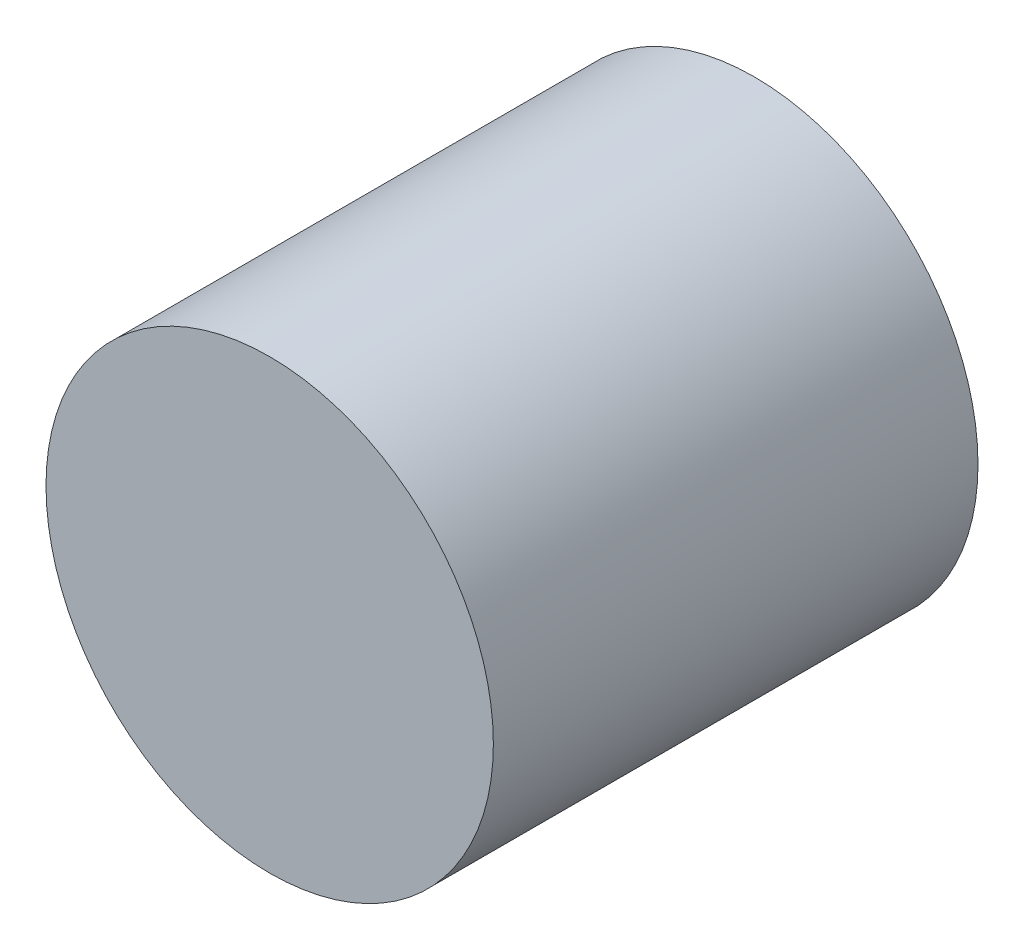
ISO-10303-21;
HEADER;
FILE_DESCRIPTION(('STEP AP214'),'2;1');
FILE_NAME('part.step','',(''),(''),'','','');
FILE_SCHEMA(('AUTOMOTIVE_DESIGN { 1 0 10303 214 1 1 1 1 }'));
ENDSEC;
DATA;
#1=APPLICATION_CONTEXT('core data for automotive mechanical design processes');
#2=APPLICATION_PROTOCOL_DEFINITION('international standard','automotive_design',2000,#1);
#3=PRODUCT_CONTEXT('',#1,'mechanical');
#4=PRODUCT('Part','Part','',(#3));
#5=PRODUCT_RELATED_PRODUCT_CATEGORY('part','',(#4));
#6=PRODUCT_DEFINITION_FORMATION('','',#4);
#7=PRODUCT_DEFINITION_CONTEXT('part definition',#1,'design');
#8=PRODUCT_DEFINITION('design','',#6,#7);
#9=PRODUCT_DEFINITION_SHAPE('','',#8);
#10=(LENGTH_UNIT() NAMED_UNIT(*) SI_UNIT(.MILLI.,.METRE.));
#11=(NAMED_UNIT(*) PLANE_ANGLE_UNIT() SI_UNIT($,.RADIAN.));
#12=(NAMED_UNIT(*) SI_UNIT($,.STERADIAN.) SOLID_ANGLE_UNIT());
#13=UNCERTAINTY_MEASURE_WITH_UNIT(LENGTH_MEASURE(1.E-05),#10,'distance_accuracy_value','');
#14=(GEOMETRIC_REPRESENTATION_CONTEXT(3) GLOBAL_UNCERTAINTY_ASSIGNED_CONTEXT((#13)) GLOBAL_UNIT_ASSIGNED_CONTEXT((#10,
#11,#12)) REPRESENTATION_CONTEXT('',''));
#15=CARTESIAN_POINT('',(0.,0.,0.));
#16=DIRECTION('',(0.,0.,1.));
#17=DIRECTION('',(1.,0.,0.));
#18=AXIS2_PLACEMENT_3D('',#15,#16,#17);
#19=CARTESIAN_POINT('',(0.,0.,6.5));
#20=DIRECTION('',(0.,0.,-1.));
#21=DIRECTION('',(-1.,0.,0.));
#22=AXIS2_PLACEMENT_3D('',#19,#20,#21);
#23=CYLINDRICAL_SURFACE('',#22,3.);
#24=CARTESIAN_POINT('',(0.,0.,6.5));
#25=DIRECTION('',(0.,0.,1.));
#26=DIRECTION('',(1.,0.,0.));
#27=AXIS2_PLACEMENT_3D('',#24,#25,#26);
#28=CIRCLE('',#27,3.);
#29=CARTESIAN_POINT('',(3.,0.,6.5));
#30=VERTEX_POINT('',#29);
#31=EDGE_CURVE('E10',#30,#30,#28,.T.);
#32=ORIENTED_EDGE('',*,*,#31,.F.);
#33=EDGE_LOOP('',(#32));
#34=FACE_BOUND('',#33,.T.);
#35=CARTESIAN_POINT('',(0.,0.,0.));
#36=DIRECTION('',(0.,0.,1.));
#37=DIRECTION('',(1.,0.,0.));
#38=AXIS2_PLACEMENT_3D('',#35,#36,#37);
#39=CIRCLE('',#38,3.);
#40=CARTESIAN_POINT('',(3.,0.,0.));
#41=VERTEX_POINT('',#40);
#42=EDGE_CURVE('E34',#41,#41,#39,.T.);
#43=ORIENTED_EDGE('',*,*,#42,.T.);
#44=EDGE_LOOP('',(#43));
#45=FACE_BOUND('',#44,.T.);
#46=ADVANCED_FACE('F31',(#34,#45),#23,.T.);
#47=CARTESIAN_POINT('',(0.,0.,6.5));
#48=DIRECTION('',(0.,0.,1.));
#49=DIRECTION('',(1.,0.,0.));
#50=AXIS2_PLACEMENT_3D('',#47,#48,#49);
#51=PLANE('',#50);
#52=ORIENTED_EDGE('',*,*,#31,.T.);
#53=EDGE_LOOP('',(#52));
#54=FACE_BOUND('',#53,.T.);
#55=ADVANCED_FACE('F46',(#54),#51,.T.);
#56=CARTESIAN_POINT('',(0.,0.,0.));
#57=DIRECTION('',(0.,0.,1.));
#58=DIRECTION('',(1.,0.,0.));
#59=AXIS2_PLACEMENT_3D('',#56,#57,#58);
#60=PLANE('',#59);
#61=ORIENTED_EDGE('',*,*,#42,.F.);
#62=EDGE_LOOP('',(#61));
#63=FACE_BOUND('',#62,.T.);
#64=ADVANCED_FACE('F44',(#63),#60,.F.);
#65=CLOSED_SHELL('',(#46,#55,#64));
#66=MANIFOLD_SOLID_BREP('B2',#65);
#67=ADVANCED_BREP_SHAPE_REPRESENTATION('',(#18,#66),#14);
#68=SHAPE_DEFINITION_REPRESENTATION(#9,#67);
ENDSEC;
END-ISO-10303-21;
